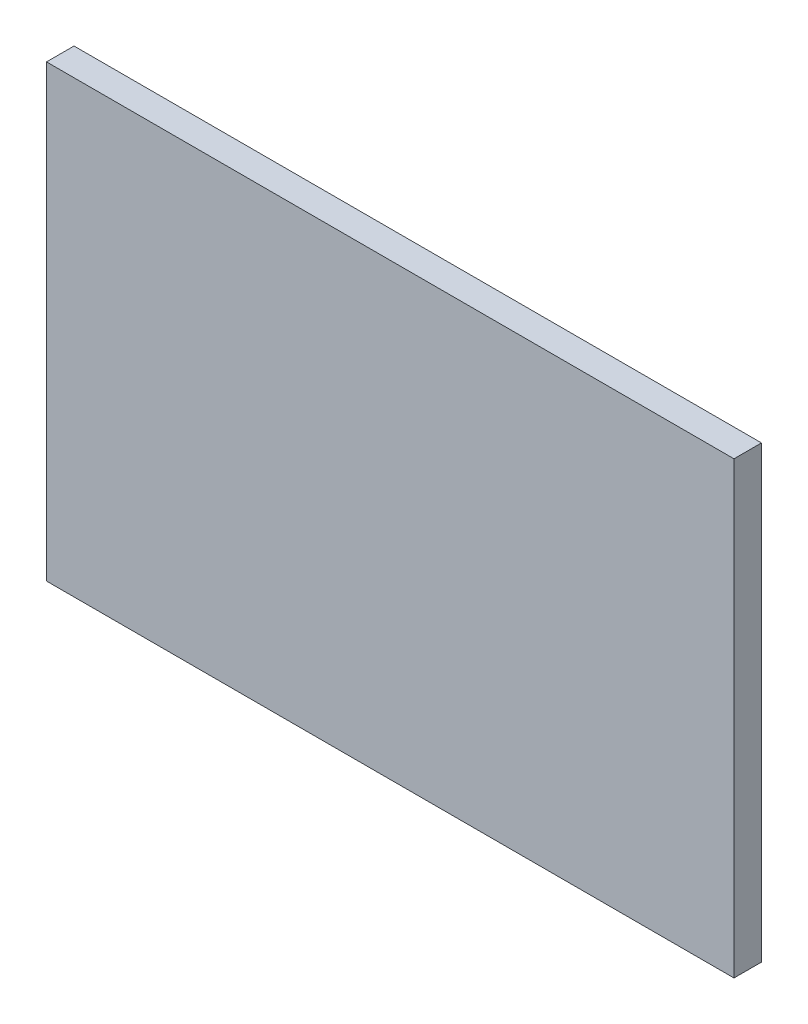
ISO-10303-21;
HEADER;
FILE_DESCRIPTION(('STEP AP214'),'2;1');
FILE_NAME('part.step','',(''),(''),'','','');
FILE_SCHEMA(('AUTOMOTIVE_DESIGN { 1 0 10303 214 1 1 1 1 }'));
ENDSEC;
DATA;
#1=APPLICATION_CONTEXT('core data for automotive mechanical design processes');
#2=APPLICATION_PROTOCOL_DEFINITION('international standard','automotive_design',2000,#1);
#3=PRODUCT_CONTEXT('',#1,'mechanical');
#4=PRODUCT('Part','Part','',(#3));
#5=PRODUCT_RELATED_PRODUCT_CATEGORY('part','',(#4));
#6=PRODUCT_DEFINITION_FORMATION('','',#4);
#7=PRODUCT_DEFINITION_CONTEXT('part definition',#1,'design');
#8=PRODUCT_DEFINITION('design','',#6,#7);
#9=PRODUCT_DEFINITION_SHAPE('','',#8);
#10=(LENGTH_UNIT() NAMED_UNIT(*) SI_UNIT(.MILLI.,.METRE.));
#11=(NAMED_UNIT(*) PLANE_ANGLE_UNIT() SI_UNIT($,.RADIAN.));
#12=(NAMED_UNIT(*) SI_UNIT($,.STERADIAN.) SOLID_ANGLE_UNIT());
#13=UNCERTAINTY_MEASURE_WITH_UNIT(LENGTH_MEASURE(1.E-05),#10,'distance_accuracy_value','');
#14=(GEOMETRIC_REPRESENTATION_CONTEXT(3) GLOBAL_UNCERTAINTY_ASSIGNED_CONTEXT((#13)) GLOBAL_UNIT_ASSIGNED_CONTEXT((#10,
#11,#12)) REPRESENTATION_CONTEXT('',''));
#15=CARTESIAN_POINT('',(0.,0.,0.));
#16=DIRECTION('',(0.,0.,1.));
#17=DIRECTION('',(1.,0.,0.));
#18=AXIS2_PLACEMENT_3D('',#15,#16,#17);
#19=CARTESIAN_POINT('',(125.,-81.7609467455621,10.));
#20=DIRECTION('',(-1.,0.,0.));
#21=DIRECTION('',(0.,0.,1.));
#22=AXIS2_PLACEMENT_3D('',#19,#20,#21);
#23=PLANE('',#22);
#24=DIRECTION('',(0.,1.,0.));
#25=VECTOR('',#24,1.);
#26=CARTESIAN_POINT('',(125.,-81.7609467455621,0.));
#27=LINE('',#26,#25);
#28=CARTESIAN_POINT('',(125.,-81.7609467455621,0.));
#29=VERTEX_POINT('',#28);
#30=CARTESIAN_POINT('',(125.,81.7609467455621,0.));
#31=VERTEX_POINT('',#30);
#32=EDGE_CURVE('E98',#29,#31,#27,.T.);
#33=ORIENTED_EDGE('',*,*,#32,.T.);
#34=DIRECTION('',(0.,0.,-1.));
#35=VECTOR('',#34,1.);
#36=CARTESIAN_POINT('',(125.,81.7609467455621,10.));
#37=LINE('',#36,#35);
#38=CARTESIAN_POINT('',(125.,81.7609467455621,10.));
#39=VERTEX_POINT('',#38);
#40=EDGE_CURVE('E11',#39,#31,#37,.T.);
#41=ORIENTED_EDGE('',*,*,#40,.F.);
#42=DIRECTION('',(0.,1.,0.));
#43=VECTOR('',#42,1.);
#44=CARTESIAN_POINT('',(125.,-81.7609467455621,10.));
#45=LINE('',#44,#43);
#46=CARTESIAN_POINT('',(125.,-81.7609467455621,10.));
#47=VERTEX_POINT('',#46);
#48=EDGE_CURVE('E86',#47,#39,#45,.T.);
#49=ORIENTED_EDGE('',*,*,#48,.F.);
#50=DIRECTION('',(0.,0.,-1.));
#51=VECTOR('',#50,1.);
#52=CARTESIAN_POINT('',(125.,-81.7609467455621,10.));
#53=LINE('',#52,#51);
#54=EDGE_CURVE('E94',#47,#29,#53,.T.);
#55=ORIENTED_EDGE('',*,*,#54,.T.);
#56=EDGE_LOOP('',(#33,#41,#49,#55));
#57=FACE_BOUND('',#56,.T.);
#58=ADVANCED_FACE('F35',(#57),#23,.F.);
#59=CARTESIAN_POINT('',(-125.,81.7609467455621,10.));
#60=DIRECTION('',(0.,-1.,0.));
#61=DIRECTION('',(0.,0.,-1.));
#62=AXIS2_PLACEMENT_3D('',#59,#60,#61);
#63=PLANE('',#62);
#64=DIRECTION('',(-1.,0.,0.));
#65=VECTOR('',#64,1.);
#66=CARTESIAN_POINT('',(-125.,81.7609467455621,0.));
#67=LINE('',#66,#65);
#68=CARTESIAN_POINT('',(-125.,81.7609467455621,0.));
#69=VERTEX_POINT('',#68);
#70=EDGE_CURVE('E90',#31,#69,#67,.T.);
#71=ORIENTED_EDGE('',*,*,#70,.T.);
#72=DIRECTION('',(0.,0.,-1.));
#73=VECTOR('',#72,1.);
#74=CARTESIAN_POINT('',(-125.,81.7609467455621,10.));
#75=LINE('',#74,#73);
#76=CARTESIAN_POINT('',(-125.,81.7609467455621,10.));
#77=VERTEX_POINT('',#76);
#78=EDGE_CURVE('E43',#77,#69,#75,.T.);
#79=ORIENTED_EDGE('',*,*,#78,.F.);
#80=DIRECTION('',(-1.,0.,0.));
#81=VECTOR('',#80,1.);
#82=CARTESIAN_POINT('',(-125.,81.7609467455621,10.));
#83=LINE('',#82,#81);
#84=EDGE_CURVE('E81',#39,#77,#83,.T.);
#85=ORIENTED_EDGE('',*,*,#84,.F.);
#86=ORIENTED_EDGE('',*,*,#40,.T.);
#87=EDGE_LOOP('',(#71,#79,#85,#86));
#88=FACE_BOUND('',#87,.T.);
#89=ADVANCED_FACE('F89',(#88),#63,.F.);
#90=CARTESIAN_POINT('',(-125.,-81.7609467455621,10.));
#91=DIRECTION('',(1.,0.,0.));
#92=DIRECTION('',(0.,0.,-1.));
#93=AXIS2_PLACEMENT_3D('',#90,#91,#92);
#94=PLANE('',#93);
#95=DIRECTION('',(0.,-1.,0.));
#96=VECTOR('',#95,1.);
#97=CARTESIAN_POINT('',(-125.,-81.7609467455621,0.));
#98=LINE('',#97,#96);
#99=CARTESIAN_POINT('',(-125.,-81.7609467455621,0.));
#100=VERTEX_POINT('',#99);
#101=EDGE_CURVE('E68',#69,#100,#98,.T.);
#102=ORIENTED_EDGE('',*,*,#101,.T.);
#103=DIRECTION('',(0.,0.,-1.));
#104=VECTOR('',#103,1.);
#105=CARTESIAN_POINT('',(-125.,-81.7609467455621,10.));
#106=LINE('',#105,#104);
#107=CARTESIAN_POINT('',(-125.,-81.7609467455621,10.));
#108=VERTEX_POINT('',#107);
#109=EDGE_CURVE('E91',#108,#100,#106,.T.);
#110=ORIENTED_EDGE('',*,*,#109,.F.);
#111=DIRECTION('',(0.,-1.,0.));
#112=VECTOR('',#111,1.);
#113=CARTESIAN_POINT('',(-125.,-81.7609467455621,10.));
#114=LINE('',#113,#112);
#115=EDGE_CURVE('E84',#77,#108,#114,.T.);
#116=ORIENTED_EDGE('',*,*,#115,.F.);
#117=ORIENTED_EDGE('',*,*,#78,.T.);
#118=EDGE_LOOP('',(#102,#110,#116,#117));
#119=FACE_BOUND('',#118,.T.);
#120=ADVANCED_FACE('F92',(#119),#94,.F.);
#121=CARTESIAN_POINT('',(-125.,-81.7609467455621,10.));
#122=DIRECTION('',(0.,1.,0.));
#123=DIRECTION('',(0.,0.,1.));
#124=AXIS2_PLACEMENT_3D('',#121,#122,#123);
#125=PLANE('',#124);
#126=DIRECTION('',(1.,0.,0.));
#127=VECTOR('',#126,1.);
#128=CARTESIAN_POINT('',(-125.,-81.7609467455621,0.));
#129=LINE('',#128,#127);
#130=EDGE_CURVE('E74',#100,#29,#129,.T.);
#131=ORIENTED_EDGE('',*,*,#130,.T.);
#132=ORIENTED_EDGE('',*,*,#54,.F.);
#133=DIRECTION('',(1.,0.,0.));
#134=VECTOR('',#133,1.);
#135=CARTESIAN_POINT('',(-125.,-81.7609467455621,10.));
#136=LINE('',#135,#134);
#137=EDGE_CURVE('E51',#108,#47,#136,.T.);
#138=ORIENTED_EDGE('',*,*,#137,.F.);
#139=ORIENTED_EDGE('',*,*,#109,.T.);
#140=EDGE_LOOP('',(#131,#132,#138,#139));
#141=FACE_BOUND('',#140,.T.);
#142=ADVANCED_FACE('F105',(#141),#125,.F.);
#143=CARTESIAN_POINT('',(0.,0.,10.));
#144=DIRECTION('',(0.,0.,-1.));
#145=DIRECTION('',(-1.,0.,0.));
#146=AXIS2_PLACEMENT_3D('',#143,#144,#145);
#147=PLANE('',#146);
#148=ORIENTED_EDGE('',*,*,#48,.T.);
#149=ORIENTED_EDGE('',*,*,#84,.T.);
#150=ORIENTED_EDGE('',*,*,#115,.T.);
#151=ORIENTED_EDGE('',*,*,#137,.T.);
#152=EDGE_LOOP('',(#148,#149,#150,#151));
#153=FACE_BOUND('',#152,.T.);
#154=ADVANCED_FACE('F82',(#153),#147,.F.);
#155=CARTESIAN_POINT('',(0.,0.,0.));
#156=DIRECTION('',(0.,0.,-1.));
#157=DIRECTION('',(-1.,0.,0.));
#158=AXIS2_PLACEMENT_3D('',#155,#156,#157);
#159=PLANE('',#158);
#160=ORIENTED_EDGE('',*,*,#32,.F.);
#161=ORIENTED_EDGE('',*,*,#130,.F.);
#162=ORIENTED_EDGE('',*,*,#101,.F.);
#163=ORIENTED_EDGE('',*,*,#70,.F.);
#164=EDGE_LOOP('',(#160,#161,#162,#163));
#165=FACE_BOUND('',#164,.T.);
#166=ADVANCED_FACE('F108',(#165),#159,.T.);
#167=CLOSED_SHELL('',(#58,#89,#120,#142,#154,#166));
#168=MANIFOLD_SOLID_BREP('B2',#167);
#169=ADVANCED_BREP_SHAPE_REPRESENTATION('',(#18,#168),#14);
#170=SHAPE_DEFINITION_REPRESENTATION(#9,#169);
ENDSEC;
END-ISO-10303-21;
